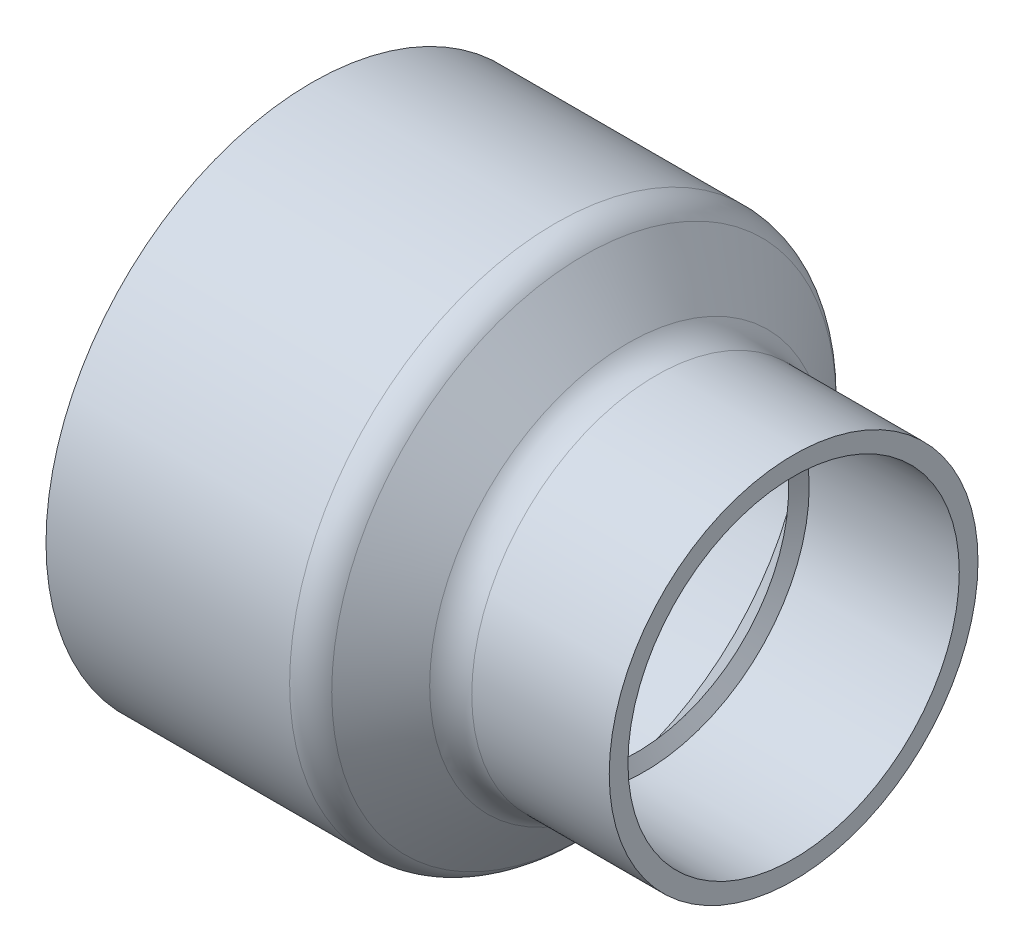
ISO-10303-21;
HEADER;
FILE_DESCRIPTION(('STEP AP214'),'2;1');
FILE_NAME('part.step','',(''),(''),'','','');
FILE_SCHEMA(('AUTOMOTIVE_DESIGN { 1 0 10303 214 1 1 1 1 }'));
ENDSEC;
DATA;
#1=APPLICATION_CONTEXT('core data for automotive mechanical design processes');
#2=APPLICATION_PROTOCOL_DEFINITION('international standard','automotive_design',2000,#1);
#3=PRODUCT_CONTEXT('',#1,'mechanical');
#4=PRODUCT('Part','Part','',(#3));
#5=PRODUCT_RELATED_PRODUCT_CATEGORY('part','',(#4));
#6=PRODUCT_DEFINITION_FORMATION('','',#4);
#7=PRODUCT_DEFINITION_CONTEXT('part definition',#1,'design');
#8=PRODUCT_DEFINITION('design','',#6,#7);
#9=PRODUCT_DEFINITION_SHAPE('','',#8);
#10=(LENGTH_UNIT() NAMED_UNIT(*) SI_UNIT(.MILLI.,.METRE.));
#11=(NAMED_UNIT(*) PLANE_ANGLE_UNIT() SI_UNIT($,.RADIAN.));
#12=(NAMED_UNIT(*) SI_UNIT($,.STERADIAN.) SOLID_ANGLE_UNIT());
#13=UNCERTAINTY_MEASURE_WITH_UNIT(LENGTH_MEASURE(1.E-05),#10,'distance_accuracy_value','');
#14=(GEOMETRIC_REPRESENTATION_CONTEXT(3) GLOBAL_UNCERTAINTY_ASSIGNED_CONTEXT((#13)) GLOBAL_UNIT_ASSIGNED_CONTEXT((#10,
#11,#12)) REPRESENTATION_CONTEXT('',''));
#15=CARTESIAN_POINT('',(0.,0.,0.));
#16=DIRECTION('',(0.,0.,1.));
#17=DIRECTION('',(1.,0.,0.));
#18=AXIS2_PLACEMENT_3D('',#15,#16,#17);
#19=CARTESIAN_POINT('',(-83.4517,0.,0.));
#20=DIRECTION('',(-1.,0.,0.));
#21=DIRECTION('',(0.,0.,1.));
#22=AXIS2_PLACEMENT_3D('',#19,#20,#21);
#23=CYLINDRICAL_SURFACE('',#22,92.0115);
#24=CARTESIAN_POINT('',(0.9211686270508,0.,0.));
#25=DIRECTION('',(1.,0.,0.));
#26=DIRECTION('',(0.,0.,-1.));
#27=AXIS2_PLACEMENT_3D('',#24,#25,#26);
#28=CIRCLE('',#27,92.0115);
#29=CARTESIAN_POINT('',(0.9211686270508,0.,-92.0115));
#30=VERTEX_POINT('',#29);
#31=EDGE_CURVE('E45',#30,#30,#28,.F.);
#32=ORIENTED_EDGE('',*,*,#31,.T.);
#33=EDGE_LOOP('',(#32));
#34=FACE_BOUND('',#33,.T.);
#35=CARTESIAN_POINT('',(-83.4517,0.,0.));
#36=DIRECTION('',(-1.,0.,0.));
#37=DIRECTION('',(0.,0.,1.));
#38=AXIS2_PLACEMENT_3D('',#35,#36,#37);
#39=CIRCLE('',#38,92.0115);
#40=CARTESIAN_POINT('',(-83.4517,0.,92.0115));
#41=VERTEX_POINT('',#40);
#42=EDGE_CURVE('E50',#41,#41,#39,.T.);
#43=ORIENTED_EDGE('',*,*,#42,.F.);
#44=EDGE_LOOP('',(#43));
#45=FACE_BOUND('',#44,.T.);
#46=ADVANCED_FACE('F30',(#34,#45),#23,.T.);
#47=CARTESIAN_POINT('',(-83.4517,-92.0115,0.));
#48=DIRECTION('',(-1.,0.,0.));
#49=DIRECTION('',(0.,0.,1.));
#50=AXIS2_PLACEMENT_3D('',#47,#48,#49);
#51=PLANE('',#50);
#52=ORIENTED_EDGE('',*,*,#42,.T.);
#53=EDGE_LOOP('',(#52));
#54=FACE_BOUND('',#53,.T.);
#55=CARTESIAN_POINT('',(-83.4517,0.,0.));
#56=DIRECTION('',(-1.,0.,0.));
#57=DIRECTION('',(0.,0.,1.));
#58=AXIS2_PLACEMENT_3D('',#55,#56,#57);
#59=CIRCLE('',#58,84.4169);
#60=CARTESIAN_POINT('',(-83.4517,0.,84.4169));
#61=VERTEX_POINT('',#60);
#62=EDGE_CURVE('E53',#61,#61,#59,.T.);
#63=ORIENTED_EDGE('',*,*,#62,.F.);
#64=EDGE_LOOP('',(#63));
#65=FACE_BOUND('',#64,.T.);
#66=ADVANCED_FACE('F89',(#54,#65),#51,.T.);
#67=CARTESIAN_POINT('',(3.69570000000002,0.,0.));
#68=DIRECTION('',(-1.,0.,0.));
#69=DIRECTION('',(0.,0.,1.));
#70=AXIS2_PLACEMENT_3D('',#67,#68,#69);
#71=CONICAL_SURFACE('',#70,83.9978,0.00480905648533097);
#72=ORIENTED_EDGE('',*,*,#62,.T.);
#73=EDGE_LOOP('',(#72));
#74=FACE_BOUND('',#73,.T.);
#75=CARTESIAN_POINT('',(3.69570000000002,0.,0.));
#76=DIRECTION('',(-1.,0.,0.));
#77=DIRECTION('',(0.,0.,1.));
#78=AXIS2_PLACEMENT_3D('',#75,#76,#77);
#79=CIRCLE('',#78,83.9978);
#80=CARTESIAN_POINT('',(3.69570000000002,0.,83.9978));
#81=VERTEX_POINT('',#80);
#82=EDGE_CURVE('E56',#81,#81,#79,.T.);
#83=ORIENTED_EDGE('',*,*,#82,.F.);
#84=EDGE_LOOP('',(#83));
#85=FACE_BOUND('',#84,.T.);
#86=ADVANCED_FACE('F95',(#74,#85),#71,.F.);
#87=CARTESIAN_POINT('',(29.197852081023,0.,0.));
#88=DIRECTION('',(-1.,0.,0.));
#89=DIRECTION('',(0.,0.,1.));
#90=AXIS2_PLACEMENT_3D('',#87,#88,#89);
#91=CONICAL_SURFACE('',#90,52.50526490962,0.890117918517114);
#92=ORIENTED_EDGE('',*,*,#82,.T.);
#93=EDGE_LOOP('',(#92));
#94=FACE_BOUND('',#93,.T.);
#95=CARTESIAN_POINT('',(29.197852081023,0.,0.));
#96=DIRECTION('',(-1.,0.,0.));
#97=DIRECTION('',(0.,0.,1.));
#98=AXIS2_PLACEMENT_3D('',#95,#96,#97);
#99=CIRCLE('',#98,52.50526490962);
#100=CARTESIAN_POINT('',(29.197852081023,0.,52.50526490962));
#101=VERTEX_POINT('',#100);
#102=EDGE_CURVE('E59',#101,#101,#99,.T.);
#103=ORIENTED_EDGE('',*,*,#102,.F.);
#104=EDGE_LOOP('',(#103));
#105=FACE_BOUND('',#104,.T.);
#106=ADVANCED_FACE('F144',(#94,#105),#91,.F.);
#107=CARTESIAN_POINT('',(31.8135,0.,0.));
#108=DIRECTION('',(1.,0.,0.));
#109=DIRECTION('',(0.,0.,-1.));
#110=AXIS2_PLACEMENT_3D('',#107,#108,#109);
#111=CONICAL_SURFACE('',#110,57.0357,1.0471975511966);
#112=ORIENTED_EDGE('',*,*,#102,.T.);
#113=EDGE_LOOP('',(#112));
#114=FACE_BOUND('',#113,.T.);
#115=CARTESIAN_POINT('',(31.8135,0.,0.));
#116=DIRECTION('',(-1.,0.,0.));
#117=DIRECTION('',(0.,0.,1.));
#118=AXIS2_PLACEMENT_3D('',#115,#116,#117);
#119=CIRCLE('',#118,57.0357);
#120=CARTESIAN_POINT('',(31.8135,0.,57.0357));
#121=VERTEX_POINT('',#120);
#122=EDGE_CURVE('E62',#121,#121,#119,.T.);
#123=ORIENTED_EDGE('',*,*,#122,.F.);
#124=EDGE_LOOP('',(#123));
#125=FACE_BOUND('',#124,.T.);
#126=ADVANCED_FACE('F85',(#114,#125),#111,.F.);
#127=CARTESIAN_POINT('',(83.4517,0.,0.));
#128=DIRECTION('',(1.,0.,0.));
#129=DIRECTION('',(0.,0.,-1.));
#130=AXIS2_PLACEMENT_3D('',#127,#128,#129);
#131=CONICAL_SURFACE('',#130,57.3786,0.00664033525636069);
#132=ORIENTED_EDGE('',*,*,#122,.T.);
#133=EDGE_LOOP('',(#132));
#134=FACE_BOUND('',#133,.T.);
#135=CARTESIAN_POINT('',(83.4517,0.,0.));
#136=DIRECTION('',(-1.,0.,0.));
#137=DIRECTION('',(0.,0.,1.));
#138=AXIS2_PLACEMENT_3D('',#135,#136,#137);
#139=CIRCLE('',#138,57.3786);
#140=CARTESIAN_POINT('',(83.4517,0.,57.3786));
#141=VERTEX_POINT('',#140);
#142=EDGE_CURVE('E65',#141,#141,#139,.T.);
#143=ORIENTED_EDGE('',*,*,#142,.F.);
#144=EDGE_LOOP('',(#143));
#145=FACE_BOUND('',#144,.T.);
#146=ADVANCED_FACE('F76',(#134,#145),#131,.F.);
#147=CARTESIAN_POINT('',(83.4517,-57.3786,0.));
#148=DIRECTION('',(1.,0.,0.));
#149=DIRECTION('',(0.,0.,-1.));
#150=AXIS2_PLACEMENT_3D('',#147,#148,#149);
#151=PLANE('',#150);
#152=ORIENTED_EDGE('',*,*,#142,.T.);
#153=EDGE_LOOP('',(#152));
#154=FACE_BOUND('',#153,.T.);
#155=CARTESIAN_POINT('',(83.4517,0.,0.));
#156=DIRECTION('',(-1.,0.,0.));
#157=DIRECTION('',(0.,0.,1.));
#158=AXIS2_PLACEMENT_3D('',#155,#156,#157);
#159=CIRCLE('',#158,63.8556);
#160=CARTESIAN_POINT('',(83.4517,0.,63.8556));
#161=VERTEX_POINT('',#160);
#162=EDGE_CURVE('E68',#161,#161,#159,.T.);
#163=ORIENTED_EDGE('',*,*,#162,.F.);
#164=EDGE_LOOP('',(#163));
#165=FACE_BOUND('',#164,.T.);
#166=ADVANCED_FACE('F74',(#154,#165),#151,.T.);
#167=CARTESIAN_POINT('',(-83.4517,0.,0.));
#168=DIRECTION('',(-1.,0.,0.));
#169=DIRECTION('',(0.,0.,1.));
#170=AXIS2_PLACEMENT_3D('',#167,#168,#169);
#171=CYLINDRICAL_SURFACE('',#170,63.8556);
#172=CARTESIAN_POINT('',(35.8365454178192,0.,0.));
#173=DIRECTION('',(-1.,0.,0.));
#174=DIRECTION('',(0.,0.,1.));
#175=AXIS2_PLACEMENT_3D('',#172,#173,#174);
#176=CIRCLE('',#175,63.8556);
#177=CARTESIAN_POINT('',(35.8365454178192,0.,63.8556));
#178=VERTEX_POINT('',#177);
#179=EDGE_CURVE('E10',#178,#178,#176,.F.);
#180=ORIENTED_EDGE('',*,*,#179,.T.);
#181=EDGE_LOOP('',(#180));
#182=FACE_BOUND('',#181,.T.);
#183=ORIENTED_EDGE('',*,*,#162,.T.);
#184=EDGE_LOOP('',(#183));
#185=FACE_BOUND('',#184,.T.);
#186=ADVANCED_FACE('F72',(#182,#185),#171,.T.);
#187=CARTESIAN_POINT('',(6.97875789231749,0.,0.));
#188=DIRECTION('',(-1.,0.,0.));
#189=DIRECTION('',(0.,0.,1.));
#190=AXIS2_PLACEMENT_3D('',#187,#188,#189);
#191=CONICAL_SURFACE('',#190,92.0115,0.890117918517113);
#192=CARTESIAN_POINT('',(10.7909223375544,0.,0.));
#193=DIRECTION('',(1.,0.,0.));
#194=DIRECTION('',(0.,0.,-1.));
#195=AXIS2_PLACEMENT_3D('',#192,#193,#194);
#196=CIRCLE('',#195,87.3038689663329);
#197=CARTESIAN_POINT('',(10.7909223375544,0.,-87.3038689663329));
#198=VERTEX_POINT('',#197);
#199=EDGE_CURVE('E37',#198,#198,#196,.T.);
#200=ORIENTED_EDGE('',*,*,#199,.T.);
#201=EDGE_LOOP('',(#200));
#202=FACE_BOUND('',#201,.T.);
#203=CARTESIAN_POINT('',(25.9667917073156,0.,0.));
#204=DIRECTION('',(-1.,0.,0.));
#205=DIRECTION('',(0.,0.,1.));
#206=AXIS2_PLACEMENT_3D('',#203,#204,#205);
#207=CIRCLE('',#206,68.5632310336671);
#208=CARTESIAN_POINT('',(25.9667917073156,0.,68.5632310336671));
#209=VERTEX_POINT('',#208);
#210=EDGE_CURVE('E41',#209,#209,#207,.T.);
#211=ORIENTED_EDGE('',*,*,#210,.T.);
#212=EDGE_LOOP('',(#211));
#213=FACE_BOUND('',#212,.T.);
#214=ADVANCED_FACE('F83',(#202,#213),#191,.T.);
#215=CARTESIAN_POINT('',(0.9211686270508,0.,0.));
#216=DIRECTION('',(1.,0.,0.));
#217=DIRECTION('',(0.,0.,-1.));
#218=AXIS2_PLACEMENT_3D('',#215,#216,#217);
#219=TOROIDAL_SURFACE('',#218,79.3115,12.7);
#220=ORIENTED_EDGE('',*,*,#199,.F.);
#221=EDGE_LOOP('',(#220));
#222=FACE_BOUND('',#221,.T.);
#223=ORIENTED_EDGE('',*,*,#31,.F.);
#224=EDGE_LOOP('',(#223));
#225=FACE_BOUND('',#224,.T.);
#226=ADVANCED_FACE('F100',(#222,#225),#219,.T.);
#227=CARTESIAN_POINT('',(35.8365454178192,0.,0.));
#228=DIRECTION('',(-1.,0.,0.));
#229=DIRECTION('',(0.,0.,1.));
#230=AXIS2_PLACEMENT_3D('',#227,#228,#229);
#231=TOROIDAL_SURFACE('',#230,76.5556,12.7);
#232=ORIENTED_EDGE('',*,*,#179,.F.);
#233=EDGE_LOOP('',(#232));
#234=FACE_BOUND('',#233,.T.);
#235=ORIENTED_EDGE('',*,*,#210,.F.);
#236=EDGE_LOOP('',(#235));
#237=FACE_BOUND('',#236,.T.);
#238=ADVANCED_FACE('F32',(#234,#237),#231,.F.);
#239=CLOSED_SHELL('',(#46,#66,#86,#106,#126,#146,#166,#186,#214,#226,#238));
#240=MANIFOLD_SOLID_BREP('B2',#239);
#241=ADVANCED_BREP_SHAPE_REPRESENTATION('',(#18,#240),#14);
#242=SHAPE_DEFINITION_REPRESENTATION(#9,#241);
ENDSEC;
END-ISO-10303-21;
